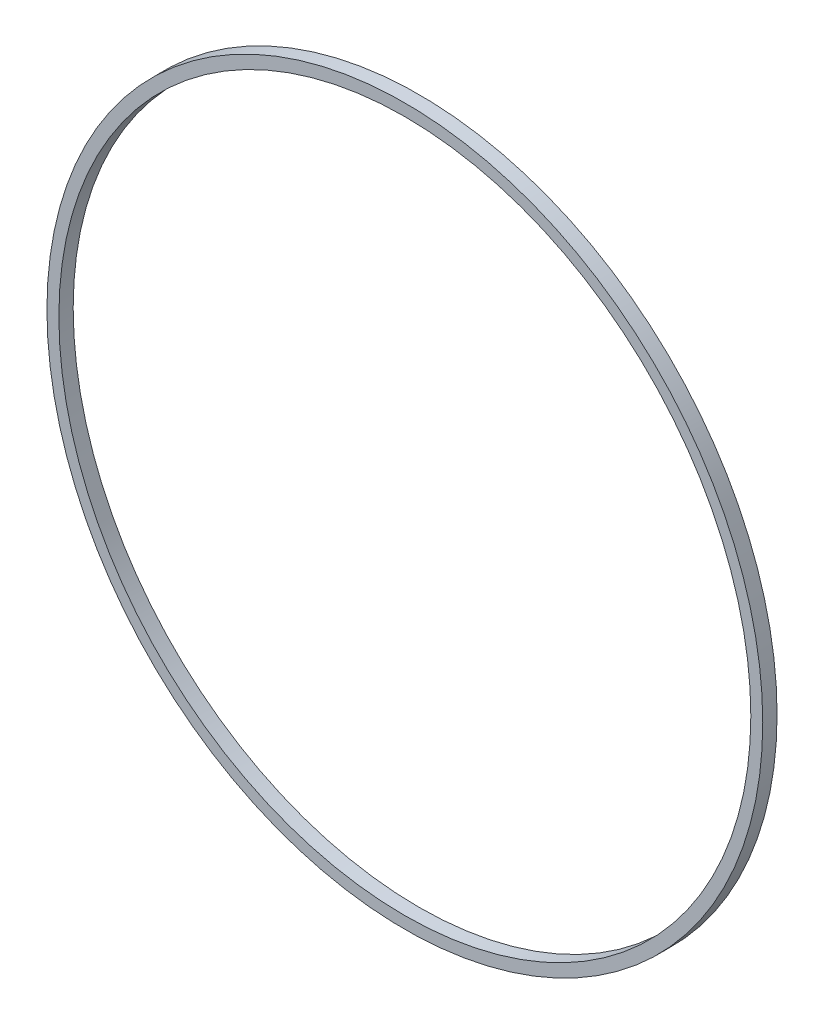
ISO-10303-21;
HEADER;
FILE_DESCRIPTION(('STEP AP214'),'2;1');
FILE_NAME('part.step','',(''),(''),'','','');
FILE_SCHEMA(('AUTOMOTIVE_DESIGN { 1 0 10303 214 1 1 1 1 }'));
ENDSEC;
DATA;
#1=APPLICATION_CONTEXT('core data for automotive mechanical design processes');
#2=APPLICATION_PROTOCOL_DEFINITION('international standard','automotive_design',2000,#1);
#3=PRODUCT_CONTEXT('',#1,'mechanical');
#4=PRODUCT('Part','Part','',(#3));
#5=PRODUCT_RELATED_PRODUCT_CATEGORY('part','',(#4));
#6=PRODUCT_DEFINITION_FORMATION('','',#4);
#7=PRODUCT_DEFINITION_CONTEXT('part definition',#1,'design');
#8=PRODUCT_DEFINITION('design','',#6,#7);
#9=PRODUCT_DEFINITION_SHAPE('','',#8);
#10=(LENGTH_UNIT() NAMED_UNIT(*) SI_UNIT(.MILLI.,.METRE.));
#11=(NAMED_UNIT(*) PLANE_ANGLE_UNIT() SI_UNIT($,.RADIAN.));
#12=(NAMED_UNIT(*) SI_UNIT($,.STERADIAN.) SOLID_ANGLE_UNIT());
#13=UNCERTAINTY_MEASURE_WITH_UNIT(LENGTH_MEASURE(1.E-05),#10,'distance_accuracy_value','');
#14=(GEOMETRIC_REPRESENTATION_CONTEXT(3) GLOBAL_UNCERTAINTY_ASSIGNED_CONTEXT((#13)) GLOBAL_UNIT_ASSIGNED_CONTEXT((#10,
#11,#12)) REPRESENTATION_CONTEXT('',''));
#15=CARTESIAN_POINT('',(0.,0.,0.));
#16=DIRECTION('',(0.,0.,1.));
#17=DIRECTION('',(1.,0.,0.));
#18=AXIS2_PLACEMENT_3D('',#15,#16,#17);
#19=CARTESIAN_POINT('',(-11.8269107916239,13.5229071012538,1.2));
#20=DIRECTION('',(0.,0.,1.));
#21=DIRECTION('',(1.,0.,0.));
#22=AXIS2_PLACEMENT_3D('',#19,#20,#21);
#23=PLANE('',#22);
#24=CARTESIAN_POINT('',(-11.8269107916239,13.5229071012538,1.2));
#25=DIRECTION('',(0.,0.,1.));
#26=DIRECTION('',(1.,0.,0.));
#27=AXIS2_PLACEMENT_3D('',#24,#25,#26);
#28=CIRCLE('',#27,30.);
#29=CARTESIAN_POINT('',(18.1730892083761,13.5229071012538,1.2));
#30=VERTEX_POINT('',#29);
#31=EDGE_CURVE('E10',#30,#30,#28,.T.);
#32=ORIENTED_EDGE('',*,*,#31,.T.);
#33=EDGE_LOOP('',(#32));
#34=FACE_BOUND('',#33,.T.);
#35=CARTESIAN_POINT('',(-11.8269107916239,13.5229071012538,1.2));
#36=DIRECTION('',(0.,0.,1.));
#37=DIRECTION('',(1.,0.,0.));
#38=AXIS2_PLACEMENT_3D('',#35,#36,#37);
#39=CIRCLE('',#38,29.);
#40=CARTESIAN_POINT('',(17.1730892083761,13.5229071012538,1.2));
#41=VERTEX_POINT('',#40);
#42=EDGE_CURVE('E46',#41,#41,#39,.T.);
#43=ORIENTED_EDGE('',*,*,#42,.F.);
#44=EDGE_LOOP('',(#43));
#45=FACE_BOUND('',#44,.T.);
#46=ADVANCED_FACE('F35',(#34,#45),#23,.T.);
#47=CARTESIAN_POINT('',(-11.8269107916239,13.5229071012538,0.));
#48=DIRECTION('',(0.,0.,1.));
#49=DIRECTION('',(1.,0.,0.));
#50=AXIS2_PLACEMENT_3D('',#47,#48,#49);
#51=PLANE('',#50);
#52=CARTESIAN_POINT('',(-11.8269107916239,13.5229071012538,0.));
#53=DIRECTION('',(0.,0.,1.));
#54=DIRECTION('',(1.,0.,0.));
#55=AXIS2_PLACEMENT_3D('',#52,#53,#54);
#56=CIRCLE('',#55,30.);
#57=CARTESIAN_POINT('',(18.1730892083761,13.5229071012538,0.));
#58=VERTEX_POINT('',#57);
#59=EDGE_CURVE('E39',#58,#58,#56,.T.);
#60=ORIENTED_EDGE('',*,*,#59,.F.);
#61=EDGE_LOOP('',(#60));
#62=FACE_BOUND('',#61,.T.);
#63=CARTESIAN_POINT('',(-11.8269107916239,13.5229071012538,0.));
#64=DIRECTION('',(0.,0.,1.));
#65=DIRECTION('',(1.,0.,0.));
#66=AXIS2_PLACEMENT_3D('',#63,#64,#65);
#67=CIRCLE('',#66,29.);
#68=CARTESIAN_POINT('',(17.1730892083761,13.5229071012538,0.));
#69=VERTEX_POINT('',#68);
#70=EDGE_CURVE('E48',#69,#69,#67,.T.);
#71=ORIENTED_EDGE('',*,*,#70,.T.);
#72=EDGE_LOOP('',(#71));
#73=FACE_BOUND('',#72,.T.);
#74=ADVANCED_FACE('F58',(#62,#73),#51,.F.);
#75=CARTESIAN_POINT('',(-11.8269107916239,13.5229071012538,1.2));
#76=DIRECTION('',(0.,0.,-1.));
#77=DIRECTION('',(-1.,0.,0.));
#78=AXIS2_PLACEMENT_3D('',#75,#76,#77);
#79=CYLINDRICAL_SURFACE('',#78,30.);
#80=ORIENTED_EDGE('',*,*,#31,.F.);
#81=EDGE_LOOP('',(#80));
#82=FACE_BOUND('',#81,.T.);
#83=ORIENTED_EDGE('',*,*,#59,.T.);
#84=EDGE_LOOP('',(#83));
#85=FACE_BOUND('',#84,.T.);
#86=ADVANCED_FACE('F37',(#82,#85),#79,.T.);
#87=CARTESIAN_POINT('',(-11.8269107916239,13.5229071012538,1.2));
#88=DIRECTION('',(0.,0.,-1.));
#89=DIRECTION('',(-1.,0.,0.));
#90=AXIS2_PLACEMENT_3D('',#87,#88,#89);
#91=CYLINDRICAL_SURFACE('',#90,29.);
#92=ORIENTED_EDGE('',*,*,#42,.T.);
#93=EDGE_LOOP('',(#92));
#94=FACE_BOUND('',#93,.T.);
#95=ORIENTED_EDGE('',*,*,#70,.F.);
#96=EDGE_LOOP('',(#95));
#97=FACE_BOUND('',#96,.T.);
#98=ADVANCED_FACE('F54',(#94,#97),#91,.F.);
#99=CLOSED_SHELL('',(#46,#74,#86,#98));
#100=MANIFOLD_SOLID_BREP('B2',#99);
#101=ADVANCED_BREP_SHAPE_REPRESENTATION('',(#18,#100),#14);
#102=SHAPE_DEFINITION_REPRESENTATION(#9,#101);
ENDSEC;
END-ISO-10303-21;
